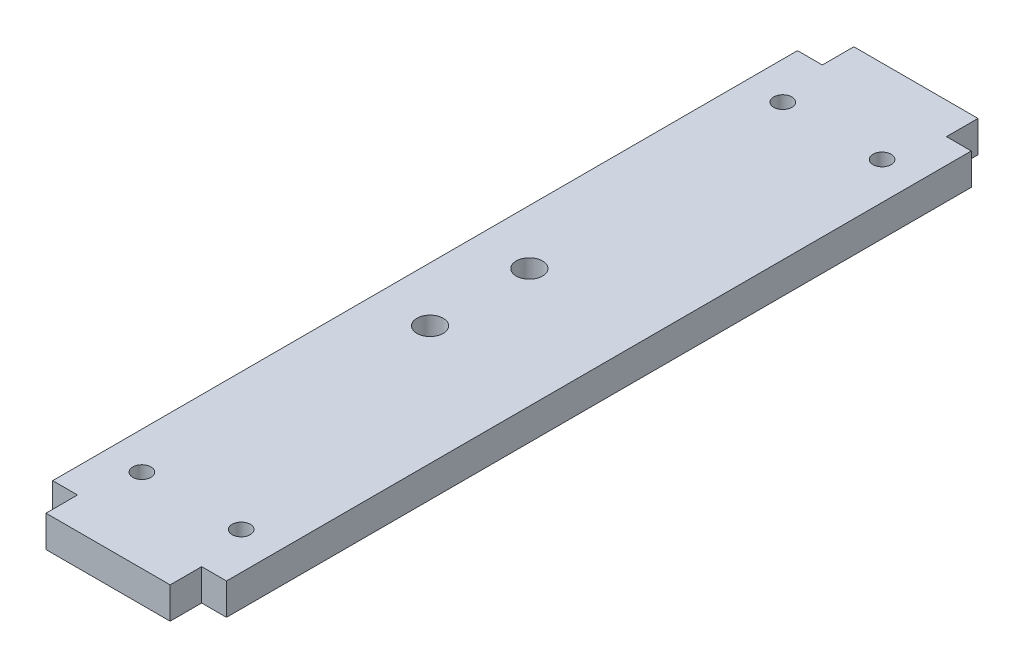
ISO-10303-21;
HEADER;
FILE_DESCRIPTION(('STEP AP214'),'2;1');
FILE_NAME('part.step','',(''),(''),'','','');
FILE_SCHEMA(('AUTOMOTIVE_DESIGN { 1 0 10303 214 1 1 1 1 }'));
ENDSEC;
DATA;
#1=APPLICATION_CONTEXT('core data for automotive mechanical design processes');
#2=APPLICATION_PROTOCOL_DEFINITION('international standard','automotive_design',2000,#1);
#3=PRODUCT_CONTEXT('',#1,'mechanical');
#4=PRODUCT('Part','Part','',(#3));
#5=PRODUCT_RELATED_PRODUCT_CATEGORY('part','',(#4));
#6=PRODUCT_DEFINITION_FORMATION('','',#4);
#7=PRODUCT_DEFINITION_CONTEXT('part definition',#1,'design');
#8=PRODUCT_DEFINITION('design','',#6,#7);
#9=PRODUCT_DEFINITION_SHAPE('','',#8);
#10=(LENGTH_UNIT() NAMED_UNIT(*) SI_UNIT(.MILLI.,.METRE.));
#11=(NAMED_UNIT(*) PLANE_ANGLE_UNIT() SI_UNIT($,.RADIAN.));
#12=(NAMED_UNIT(*) SI_UNIT($,.STERADIAN.) SOLID_ANGLE_UNIT());
#13=UNCERTAINTY_MEASURE_WITH_UNIT(LENGTH_MEASURE(1.E-05),#10,'distance_accuracy_value','');
#14=(GEOMETRIC_REPRESENTATION_CONTEXT(3) GLOBAL_UNCERTAINTY_ASSIGNED_CONTEXT((#13)) GLOBAL_UNIT_ASSIGNED_CONTEXT((#10,
#11,#12)) REPRESENTATION_CONTEXT('',''));
#15=CARTESIAN_POINT('',(0.,0.,0.));
#16=DIRECTION('',(0.,0.,1.));
#17=DIRECTION('',(1.,0.,0.));
#18=AXIS2_PLACEMENT_3D('',#15,#16,#17);
#19=CARTESIAN_POINT('',(17.5,6.35,-75.));
#20=DIRECTION('',(0.,0.,1.));
#21=DIRECTION('',(1.,0.,0.));
#22=AXIS2_PLACEMENT_3D('',#19,#20,#21);
#23=PLANE('',#22);
#24=DIRECTION('',(0.,1.,0.));
#25=VECTOR('',#24,1.);
#26=CARTESIAN_POINT('',(-12.4999999999999,0.,-75.));
#27=LINE('',#26,#25);
#28=CARTESIAN_POINT('',(-12.4999999999999,0.,-75.));
#29=VERTEX_POINT('',#28);
#30=CARTESIAN_POINT('',(-12.4999999999999,6.35,-75.));
#31=VERTEX_POINT('',#30);
#32=EDGE_CURVE('E156',#29,#31,#27,.T.);
#33=ORIENTED_EDGE('',*,*,#32,.F.);
#34=DIRECTION('',(-1.,0.,0.));
#35=VECTOR('',#34,1.);
#36=CARTESIAN_POINT('',(17.5,0.,-75.));
#37=LINE('',#36,#35);
#38=CARTESIAN_POINT('',(-17.5,0.,-75.));
#39=VERTEX_POINT('',#38);
#40=EDGE_CURVE('E205',#29,#39,#37,.T.);
#41=ORIENTED_EDGE('',*,*,#40,.T.);
#42=DIRECTION('',(0.,-1.,0.));
#43=VECTOR('',#42,1.);
#44=CARTESIAN_POINT('',(-17.5,6.35,-75.));
#45=LINE('',#44,#43);
#46=CARTESIAN_POINT('',(-17.5,6.35,-75.));
#47=VERTEX_POINT('',#46);
#48=EDGE_CURVE('E196',#47,#39,#45,.T.);
#49=ORIENTED_EDGE('',*,*,#48,.F.);
#50=DIRECTION('',(-1.,0.,0.));
#51=VECTOR('',#50,1.);
#52=CARTESIAN_POINT('',(17.5,6.35,-75.));
#53=LINE('',#52,#51);
#54=EDGE_CURVE('E192',#31,#47,#53,.T.);
#55=ORIENTED_EDGE('',*,*,#54,.F.);
#56=EDGE_LOOP('',(#33,#41,#49,#55));
#57=FACE_BOUND('',#56,.T.);
#58=ADVANCED_FACE('F32',(#57),#23,.F.);
#59=CARTESIAN_POINT('',(17.5,6.35,75.));
#60=DIRECTION('',(0.,0.,-1.));
#61=DIRECTION('',(-1.,0.,0.));
#62=AXIS2_PLACEMENT_3D('',#59,#60,#61);
#63=PLANE('',#62);
#64=DIRECTION('',(0.,1.,0.));
#65=VECTOR('',#64,1.);
#66=CARTESIAN_POINT('',(12.5000000000001,0.,75.));
#67=LINE('',#66,#65);
#68=CARTESIAN_POINT('',(12.5000000000001,0.,75.));
#69=VERTEX_POINT('',#68);
#70=CARTESIAN_POINT('',(12.5000000000001,6.35,75.));
#71=VERTEX_POINT('',#70);
#72=EDGE_CURVE('E168',#69,#71,#67,.T.);
#73=ORIENTED_EDGE('',*,*,#72,.F.);
#74=DIRECTION('',(1.,0.,0.));
#75=VECTOR('',#74,1.);
#76=CARTESIAN_POINT('',(17.5,0.,75.));
#77=LINE('',#76,#75);
#78=CARTESIAN_POINT('',(17.5,0.,75.));
#79=VERTEX_POINT('',#78);
#80=EDGE_CURVE('E199',#69,#79,#77,.T.);
#81=ORIENTED_EDGE('',*,*,#80,.T.);
#82=DIRECTION('',(0.,-1.,0.));
#83=VECTOR('',#82,1.);
#84=CARTESIAN_POINT('',(17.5,6.35,75.));
#85=LINE('',#84,#83);
#86=CARTESIAN_POINT('',(17.5,6.35,75.));
#87=VERTEX_POINT('',#86);
#88=EDGE_CURVE('E40',#87,#79,#85,.T.);
#89=ORIENTED_EDGE('',*,*,#88,.F.);
#90=DIRECTION('',(1.,0.,0.));
#91=VECTOR('',#90,1.);
#92=CARTESIAN_POINT('',(17.5,6.35,75.));
#93=LINE('',#92,#91);
#94=EDGE_CURVE('E185',#71,#87,#93,.T.);
#95=ORIENTED_EDGE('',*,*,#94,.F.);
#96=EDGE_LOOP('',(#73,#81,#89,#95));
#97=FACE_BOUND('',#96,.T.);
#98=ADVANCED_FACE('F229',(#97),#63,.F.);
#99=CARTESIAN_POINT('',(-17.5,6.35,75.));
#100=DIRECTION('',(1.,0.,0.));
#101=DIRECTION('',(0.,0.,-1.));
#102=AXIS2_PLACEMENT_3D('',#99,#100,#101);
#103=PLANE('',#102);
#104=DIRECTION('',(0.,0.,1.));
#105=VECTOR('',#104,1.);
#106=CARTESIAN_POINT('',(-17.5,0.,75.));
#107=LINE('',#106,#105);
#108=CARTESIAN_POINT('',(-17.5,0.,75.));
#109=VERTEX_POINT('',#108);
#110=EDGE_CURVE('E176',#39,#109,#107,.T.);
#111=ORIENTED_EDGE('',*,*,#110,.T.);
#112=DIRECTION('',(0.,-1.,0.));
#113=VECTOR('',#112,1.);
#114=CARTESIAN_POINT('',(-17.5,6.35,75.));
#115=LINE('',#114,#113);
#116=CARTESIAN_POINT('',(-17.5,6.35,75.));
#117=VERTEX_POINT('',#116);
#118=EDGE_CURVE('E11',#117,#109,#115,.T.);
#119=ORIENTED_EDGE('',*,*,#118,.F.);
#120=DIRECTION('',(0.,0.,1.));
#121=VECTOR('',#120,1.);
#122=CARTESIAN_POINT('',(-17.5,6.35,75.));
#123=LINE('',#122,#121);
#124=EDGE_CURVE('E182',#47,#117,#123,.T.);
#125=ORIENTED_EDGE('',*,*,#124,.F.);
#126=ORIENTED_EDGE('',*,*,#48,.T.);
#127=EDGE_LOOP('',(#111,#119,#125,#126));
#128=FACE_BOUND('',#127,.T.);
#129=ADVANCED_FACE('F34',(#128),#103,.F.);
#130=CARTESIAN_POINT('',(-12.4999999999999,0.,75.));
#131=VERTEX_POINT('',#130);
#132=EDGE_CURVE('E200',#109,#131,#77,.T.);
#133=ORIENTED_EDGE('',*,*,#132,.T.);
#134=DIRECTION('',(0.,1.,0.));
#135=VECTOR('',#134,1.);
#136=CARTESIAN_POINT('',(-12.4999999999999,0.,75.));
#137=LINE('',#136,#135);
#138=CARTESIAN_POINT('',(-12.4999999999999,6.35,75.));
#139=VERTEX_POINT('',#138);
#140=EDGE_CURVE('E179',#131,#139,#137,.T.);
#141=ORIENTED_EDGE('',*,*,#140,.T.);
#142=EDGE_CURVE('E187',#117,#139,#93,.T.);
#143=ORIENTED_EDGE('',*,*,#142,.F.);
#144=ORIENTED_EDGE('',*,*,#118,.T.);
#145=EDGE_LOOP('',(#133,#141,#143,#144));
#146=FACE_BOUND('',#145,.T.);
#147=ADVANCED_FACE('F239',(#146),#63,.F.);
#148=CARTESIAN_POINT('',(17.5,6.35,75.));
#149=DIRECTION('',(-1.,0.,0.));
#150=DIRECTION('',(0.,0.,1.));
#151=AXIS2_PLACEMENT_3D('',#148,#149,#150);
#152=PLANE('',#151);
#153=DIRECTION('',(0.,0.,-1.));
#154=VECTOR('',#153,1.);
#155=CARTESIAN_POINT('',(17.5,0.,75.));
#156=LINE('',#155,#154);
#157=CARTESIAN_POINT('',(17.5,0.,-75.));
#158=VERTEX_POINT('',#157);
#159=EDGE_CURVE('E203',#79,#158,#156,.T.);
#160=ORIENTED_EDGE('',*,*,#159,.T.);
#161=DIRECTION('',(0.,-1.,0.));
#162=VECTOR('',#161,1.);
#163=CARTESIAN_POINT('',(17.5,6.35,-75.));
#164=LINE('',#163,#162);
#165=CARTESIAN_POINT('',(17.5,6.35,-75.));
#166=VERTEX_POINT('',#165);
#167=EDGE_CURVE('E209',#166,#158,#164,.T.);
#168=ORIENTED_EDGE('',*,*,#167,.F.);
#169=DIRECTION('',(0.,0.,-1.));
#170=VECTOR('',#169,1.);
#171=CARTESIAN_POINT('',(17.5,6.35,75.));
#172=LINE('',#171,#170);
#173=EDGE_CURVE('E190',#87,#166,#172,.T.);
#174=ORIENTED_EDGE('',*,*,#173,.F.);
#175=ORIENTED_EDGE('',*,*,#88,.T.);
#176=EDGE_LOOP('',(#160,#168,#174,#175));
#177=FACE_BOUND('',#176,.T.);
#178=ADVANCED_FACE('F216',(#177),#152,.F.);
#179=CARTESIAN_POINT('',(12.5000000000001,0.,-75.));
#180=VERTEX_POINT('',#179);
#181=EDGE_CURVE('E186',#158,#180,#37,.T.);
#182=ORIENTED_EDGE('',*,*,#181,.T.);
#183=DIRECTION('',(0.,1.,0.));
#184=VECTOR('',#183,1.);
#185=CARTESIAN_POINT('',(12.5000000000001,0.,-75.));
#186=LINE('',#185,#184);
#187=CARTESIAN_POINT('',(12.5000000000001,6.35,-75.));
#188=VERTEX_POINT('',#187);
#189=EDGE_CURVE('E142',#180,#188,#186,.T.);
#190=ORIENTED_EDGE('',*,*,#189,.T.);
#191=EDGE_CURVE('E193',#166,#188,#53,.T.);
#192=ORIENTED_EDGE('',*,*,#191,.F.);
#193=ORIENTED_EDGE('',*,*,#167,.T.);
#194=EDGE_LOOP('',(#182,#190,#192,#193));
#195=FACE_BOUND('',#194,.T.);
#196=ADVANCED_FACE('F223',(#195),#23,.F.);
#197=CARTESIAN_POINT('',(0.,6.35,0.));
#198=DIRECTION('',(0.,1.,0.));
#199=DIRECTION('',(0.,0.,1.));
#200=AXIS2_PLACEMENT_3D('',#197,#198,#199);
#201=PLANE('',#200);
#202=CARTESIAN_POINT('',(-6.5,6.35,10.));
#203=DIRECTION('',(0.,1.,0.));
#204=DIRECTION('',(0.,0.,1.));
#205=AXIS2_PLACEMENT_3D('',#202,#203,#204);
#206=CIRCLE('',#205,2.65);
#207=CARTESIAN_POINT('',(-6.5,6.35,12.65));
#208=VERTEX_POINT('',#207);
#209=EDGE_CURVE('E423',#208,#208,#206,.T.);
#210=ORIENTED_EDGE('',*,*,#209,.F.);
#211=EDGE_LOOP('',(#210));
#212=FACE_BOUND('',#211,.T.);
#213=CARTESIAN_POINT('',(-6.5,6.35,-10.));
#214=DIRECTION('',(0.,1.,0.));
#215=DIRECTION('',(0.,0.,1.));
#216=AXIS2_PLACEMENT_3D('',#213,#214,#215);
#217=CIRCLE('',#216,2.65);
#218=CARTESIAN_POINT('',(-6.5,6.35,-7.35));
#219=VERTEX_POINT('',#218);
#220=EDGE_CURVE('E425',#219,#219,#217,.T.);
#221=ORIENTED_EDGE('',*,*,#220,.F.);
#222=EDGE_LOOP('',(#221));
#223=FACE_BOUND('',#222,.T.);
#224=CARTESIAN_POINT('',(-10.,6.35,-64.5352));
#225=DIRECTION('',(0.,1.,0.));
#226=DIRECTION('',(0.,0.,1.));
#227=AXIS2_PLACEMENT_3D('',#224,#225,#226);
#228=CIRCLE('',#227,1.8288);
#229=CARTESIAN_POINT('',(-10.,6.35,-62.7064));
#230=VERTEX_POINT('',#229);
#231=EDGE_CURVE('E433',#230,#230,#228,.T.);
#232=ORIENTED_EDGE('',*,*,#231,.F.);
#233=EDGE_LOOP('',(#232));
#234=FACE_BOUND('',#233,.T.);
#235=CARTESIAN_POINT('',(10.,6.35,-64.5352));
#236=DIRECTION('',(0.,1.,0.));
#237=DIRECTION('',(0.,0.,1.));
#238=AXIS2_PLACEMENT_3D('',#235,#236,#237);
#239=CIRCLE('',#238,1.8288);
#240=CARTESIAN_POINT('',(10.,6.35,-62.7064));
#241=VERTEX_POINT('',#240);
#242=EDGE_CURVE('E439',#241,#241,#239,.T.);
#243=ORIENTED_EDGE('',*,*,#242,.F.);
#244=EDGE_LOOP('',(#243));
#245=FACE_BOUND('',#244,.T.);
#246=CARTESIAN_POINT('',(10.,6.35,64.5352));
#247=DIRECTION('',(0.,1.,0.));
#248=DIRECTION('',(0.,0.,1.));
#249=AXIS2_PLACEMENT_3D('',#246,#247,#248);
#250=CIRCLE('',#249,1.8288);
#251=CARTESIAN_POINT('',(10.,6.35,66.364));
#252=VERTEX_POINT('',#251);
#253=EDGE_CURVE('E445',#252,#252,#250,.T.);
#254=ORIENTED_EDGE('',*,*,#253,.F.);
#255=EDGE_LOOP('',(#254));
#256=FACE_BOUND('',#255,.T.);
#257=CARTESIAN_POINT('',(-10.,6.35,64.5352));
#258=DIRECTION('',(0.,1.,0.));
#259=DIRECTION('',(0.,0.,1.));
#260=AXIS2_PLACEMENT_3D('',#257,#258,#259);
#261=CIRCLE('',#260,1.8288);
#262=CARTESIAN_POINT('',(-10.,6.35,66.364));
#263=VERTEX_POINT('',#262);
#264=EDGE_CURVE('E450',#263,#263,#261,.T.);
#265=ORIENTED_EDGE('',*,*,#264,.F.);
#266=EDGE_LOOP('',(#265));
#267=FACE_BOUND('',#266,.T.);
#268=ORIENTED_EDGE('',*,*,#124,.T.);
#269=ORIENTED_EDGE('',*,*,#142,.T.);
#270=DIRECTION('',(0.,0.,1.));
#271=VECTOR('',#270,1.);
#272=CARTESIAN_POINT('',(-12.4999999999999,6.35,81.35));
#273=LINE('',#272,#271);
#274=CARTESIAN_POINT('',(-12.4999999999999,6.35,81.35));
#275=VERTEX_POINT('',#274);
#276=EDGE_CURVE('E55',#139,#275,#273,.T.);
#277=ORIENTED_EDGE('',*,*,#276,.T.);
#278=DIRECTION('',(1.,0.,0.));
#279=VECTOR('',#278,1.);
#280=CARTESIAN_POINT('',(-12.4999999999999,6.35,81.35));
#281=LINE('',#280,#279);
#282=CARTESIAN_POINT('',(12.5000000000001,6.35,81.35));
#283=VERTEX_POINT('',#282);
#284=EDGE_CURVE('E162',#275,#283,#281,.T.);
#285=ORIENTED_EDGE('',*,*,#284,.T.);
#286=DIRECTION('',(0.,0.,-1.));
#287=VECTOR('',#286,1.);
#288=CARTESIAN_POINT('',(12.5000000000001,6.35,81.35));
#289=LINE('',#288,#287);
#290=EDGE_CURVE('E155',#283,#71,#289,.T.);
#291=ORIENTED_EDGE('',*,*,#290,.T.);
#292=ORIENTED_EDGE('',*,*,#94,.T.);
#293=ORIENTED_EDGE('',*,*,#173,.T.);
#294=ORIENTED_EDGE('',*,*,#191,.T.);
#295=DIRECTION('',(0.,0.,-1.));
#296=VECTOR('',#295,1.);
#297=CARTESIAN_POINT('',(12.5000000000001,6.35,-81.35));
#298=LINE('',#297,#296);
#299=CARTESIAN_POINT('',(12.5000000000001,6.35,-81.35));
#300=VERTEX_POINT('',#299);
#301=EDGE_CURVE('E47',#188,#300,#298,.T.);
#302=ORIENTED_EDGE('',*,*,#301,.T.);
#303=DIRECTION('',(-1.,0.,0.));
#304=VECTOR('',#303,1.);
#305=CARTESIAN_POINT('',(-12.4999999999999,6.35,-81.35));
#306=LINE('',#305,#304);
#307=CARTESIAN_POINT('',(-12.4999999999999,6.35,-81.35));
#308=VERTEX_POINT('',#307);
#309=EDGE_CURVE('E126',#300,#308,#306,.T.);
#310=ORIENTED_EDGE('',*,*,#309,.T.);
#311=DIRECTION('',(0.,0.,1.));
#312=VECTOR('',#311,1.);
#313=CARTESIAN_POINT('',(-12.4999999999999,6.35,-81.35));
#314=LINE('',#313,#312);
#315=EDGE_CURVE('E143',#308,#31,#314,.T.);
#316=ORIENTED_EDGE('',*,*,#315,.T.);
#317=ORIENTED_EDGE('',*,*,#54,.T.);
#318=EDGE_LOOP('',(#268,#269,#277,#285,#291,#292,#293,#294,#302,#310,#316,#317));
#319=FACE_BOUND('',#318,.T.);
#320=ADVANCED_FACE('F226',(#212,#223,#234,#245,#256,#267,#319),#201,.T.);
#321=CARTESIAN_POINT('',(0.,0.,0.));
#322=DIRECTION('',(0.,1.,0.));
#323=DIRECTION('',(0.,0.,1.));
#324=AXIS2_PLACEMENT_3D('',#321,#322,#323);
#325=PLANE('',#324);
#326=CARTESIAN_POINT('',(-6.5,0.,10.));
#327=DIRECTION('',(0.,1.,0.));
#328=DIRECTION('',(0.,0.,1.));
#329=AXIS2_PLACEMENT_3D('',#326,#327,#328);
#330=CIRCLE('',#329,2.65);
#331=CARTESIAN_POINT('',(-6.5,0.,12.65));
#332=VERTEX_POINT('',#331);
#333=EDGE_CURVE('E420',#332,#332,#330,.T.);
#334=ORIENTED_EDGE('',*,*,#333,.T.);
#335=EDGE_LOOP('',(#334));
#336=FACE_BOUND('',#335,.T.);
#337=CARTESIAN_POINT('',(-6.5,0.,-10.));
#338=DIRECTION('',(0.,1.,0.));
#339=DIRECTION('',(0.,0.,1.));
#340=AXIS2_PLACEMENT_3D('',#337,#338,#339);
#341=CIRCLE('',#340,2.65);
#342=CARTESIAN_POINT('',(-6.5,0.,-7.35));
#343=VERTEX_POINT('',#342);
#344=EDGE_CURVE('E430',#343,#343,#341,.T.);
#345=ORIENTED_EDGE('',*,*,#344,.T.);
#346=EDGE_LOOP('',(#345));
#347=FACE_BOUND('',#346,.T.);
#348=CARTESIAN_POINT('',(-10.,0.,-64.5352));
#349=DIRECTION('',(0.,1.,0.));
#350=DIRECTION('',(0.,0.,1.));
#351=AXIS2_PLACEMENT_3D('',#348,#349,#350);
#352=CIRCLE('',#351,1.8288);
#353=CARTESIAN_POINT('',(-10.,0.,-62.7064));
#354=VERTEX_POINT('',#353);
#355=EDGE_CURVE('E436',#354,#354,#352,.T.);
#356=ORIENTED_EDGE('',*,*,#355,.T.);
#357=EDGE_LOOP('',(#356));
#358=FACE_BOUND('',#357,.T.);
#359=CARTESIAN_POINT('',(10.,0.,-64.5352));
#360=DIRECTION('',(0.,1.,0.));
#361=DIRECTION('',(0.,0.,1.));
#362=AXIS2_PLACEMENT_3D('',#359,#360,#361);
#363=CIRCLE('',#362,1.8288);
#364=CARTESIAN_POINT('',(10.,0.,-62.7064));
#365=VERTEX_POINT('',#364);
#366=EDGE_CURVE('E442',#365,#365,#363,.T.);
#367=ORIENTED_EDGE('',*,*,#366,.T.);
#368=EDGE_LOOP('',(#367));
#369=FACE_BOUND('',#368,.T.);
#370=CARTESIAN_POINT('',(10.,0.,64.5352));
#371=DIRECTION('',(0.,1.,0.));
#372=DIRECTION('',(0.,0.,1.));
#373=AXIS2_PLACEMENT_3D('',#370,#371,#372);
#374=CIRCLE('',#373,1.8288);
#375=CARTESIAN_POINT('',(10.,0.,66.364));
#376=VERTEX_POINT('',#375);
#377=EDGE_CURVE('E448',#376,#376,#374,.T.);
#378=ORIENTED_EDGE('',*,*,#377,.T.);
#379=EDGE_LOOP('',(#378));
#380=FACE_BOUND('',#379,.T.);
#381=CARTESIAN_POINT('',(-10.,0.,64.5352));
#382=DIRECTION('',(0.,1.,0.));
#383=DIRECTION('',(0.,0.,1.));
#384=AXIS2_PLACEMENT_3D('',#381,#382,#383);
#385=CIRCLE('',#384,1.8288);
#386=CARTESIAN_POINT('',(-10.,0.,66.364));
#387=VERTEX_POINT('',#386);
#388=EDGE_CURVE('E148',#387,#387,#385,.T.);
#389=ORIENTED_EDGE('',*,*,#388,.T.);
#390=EDGE_LOOP('',(#389));
#391=FACE_BOUND('',#390,.T.);
#392=ORIENTED_EDGE('',*,*,#110,.F.);
#393=ORIENTED_EDGE('',*,*,#40,.F.);
#394=DIRECTION('',(0.,0.,1.));
#395=VECTOR('',#394,1.);
#396=CARTESIAN_POINT('',(-12.4999999999999,0.,-81.35));
#397=LINE('',#396,#395);
#398=CARTESIAN_POINT('',(-12.4999999999999,0.,-81.35));
#399=VERTEX_POINT('',#398);
#400=EDGE_CURVE('E129',#399,#29,#397,.T.);
#401=ORIENTED_EDGE('',*,*,#400,.F.);
#402=DIRECTION('',(-1.,0.,0.));
#403=VECTOR('',#402,1.);
#404=CARTESIAN_POINT('',(-12.4999999999999,0.,-81.35));
#405=LINE('',#404,#403);
#406=CARTESIAN_POINT('',(12.5000000000001,0.,-81.35));
#407=VERTEX_POINT('',#406);
#408=EDGE_CURVE('E124',#407,#399,#405,.T.);
#409=ORIENTED_EDGE('',*,*,#408,.F.);
#410=DIRECTION('',(0.,0.,-1.));
#411=VECTOR('',#410,1.);
#412=CARTESIAN_POINT('',(12.5000000000001,0.,-81.35));
#413=LINE('',#412,#411);
#414=EDGE_CURVE('E137',#180,#407,#413,.T.);
#415=ORIENTED_EDGE('',*,*,#414,.F.);
#416=ORIENTED_EDGE('',*,*,#181,.F.);
#417=ORIENTED_EDGE('',*,*,#159,.F.);
#418=ORIENTED_EDGE('',*,*,#80,.F.);
#419=DIRECTION('',(0.,0.,-1.));
#420=VECTOR('',#419,1.);
#421=CARTESIAN_POINT('',(12.5000000000001,0.,81.35));
#422=LINE('',#421,#420);
#423=CARTESIAN_POINT('',(12.5000000000001,0.,81.35));
#424=VERTEX_POINT('',#423);
#425=EDGE_CURVE('E159',#424,#69,#422,.T.);
#426=ORIENTED_EDGE('',*,*,#425,.F.);
#427=DIRECTION('',(1.,0.,0.));
#428=VECTOR('',#427,1.);
#429=CARTESIAN_POINT('',(-12.4999999999999,0.,81.35));
#430=LINE('',#429,#428);
#431=CARTESIAN_POINT('',(-12.4999999999999,0.,81.35));
#432=VERTEX_POINT('',#431);
#433=EDGE_CURVE('E165',#432,#424,#430,.T.);
#434=ORIENTED_EDGE('',*,*,#433,.F.);
#435=DIRECTION('',(0.,0.,1.));
#436=VECTOR('',#435,1.);
#437=CARTESIAN_POINT('',(-12.4999999999999,0.,81.35));
#438=LINE('',#437,#436);
#439=EDGE_CURVE('E161',#131,#432,#438,.T.);
#440=ORIENTED_EDGE('',*,*,#439,.F.);
#441=ORIENTED_EDGE('',*,*,#132,.F.);
#442=EDGE_LOOP('',(#392,#393,#401,#409,#415,#416,#417,#418,#426,#434,#440,#441));
#443=FACE_BOUND('',#442,.T.);
#444=ADVANCED_FACE('F135',(#336,#347,#358,#369,#380,#391,#443),#325,.F.);
#445=CARTESIAN_POINT('',(12.5000000000001,0.,81.35));
#446=DIRECTION('',(1.,0.,0.));
#447=DIRECTION('',(0.,0.,-1.));
#448=AXIS2_PLACEMENT_3D('',#445,#446,#447);
#449=PLANE('',#448);
#450=ORIENTED_EDGE('',*,*,#290,.F.);
#451=DIRECTION('',(0.,1.,0.));
#452=VECTOR('',#451,1.);
#453=CARTESIAN_POINT('',(12.5000000000001,0.,81.35));
#454=LINE('',#453,#452);
#455=EDGE_CURVE('E174',#424,#283,#454,.T.);
#456=ORIENTED_EDGE('',*,*,#455,.F.);
#457=ORIENTED_EDGE('',*,*,#425,.T.);
#458=ORIENTED_EDGE('',*,*,#72,.T.);
#459=EDGE_LOOP('',(#450,#456,#457,#458));
#460=FACE_BOUND('',#459,.T.);
#461=ADVANCED_FACE('F231',(#460),#449,.T.);
#462=CARTESIAN_POINT('',(-12.4999999999999,0.,81.35));
#463=DIRECTION('',(0.,0.,1.));
#464=DIRECTION('',(1.,0.,0.));
#465=AXIS2_PLACEMENT_3D('',#462,#463,#464);
#466=PLANE('',#465);
#467=ORIENTED_EDGE('',*,*,#284,.F.);
#468=DIRECTION('',(0.,1.,0.));
#469=VECTOR('',#468,1.);
#470=CARTESIAN_POINT('',(-12.4999999999999,0.,81.35));
#471=LINE('',#470,#469);
#472=EDGE_CURVE('E177',#432,#275,#471,.T.);
#473=ORIENTED_EDGE('',*,*,#472,.F.);
#474=ORIENTED_EDGE('',*,*,#433,.T.);
#475=ORIENTED_EDGE('',*,*,#455,.T.);
#476=EDGE_LOOP('',(#467,#473,#474,#475));
#477=FACE_BOUND('',#476,.T.);
#478=ADVANCED_FACE('F236',(#477),#466,.T.);
#479=CARTESIAN_POINT('',(-12.4999999999999,0.,81.35));
#480=DIRECTION('',(-1.,0.,0.));
#481=DIRECTION('',(0.,0.,1.));
#482=AXIS2_PLACEMENT_3D('',#479,#480,#481);
#483=PLANE('',#482);
#484=ORIENTED_EDGE('',*,*,#276,.F.);
#485=ORIENTED_EDGE('',*,*,#140,.F.);
#486=ORIENTED_EDGE('',*,*,#439,.T.);
#487=ORIENTED_EDGE('',*,*,#472,.T.);
#488=EDGE_LOOP('',(#484,#485,#486,#487));
#489=FACE_BOUND('',#488,.T.);
#490=ADVANCED_FACE('F237',(#489),#483,.T.);
#491=CARTESIAN_POINT('',(12.5000000000001,0.,-81.35));
#492=DIRECTION('',(1.,0.,0.));
#493=DIRECTION('',(0.,0.,-1.));
#494=AXIS2_PLACEMENT_3D('',#491,#492,#493);
#495=PLANE('',#494);
#496=ORIENTED_EDGE('',*,*,#301,.F.);
#497=ORIENTED_EDGE('',*,*,#189,.F.);
#498=ORIENTED_EDGE('',*,*,#414,.T.);
#499=DIRECTION('',(0.,1.,0.));
#500=VECTOR('',#499,1.);
#501=CARTESIAN_POINT('',(12.5000000000001,0.,-81.35));
#502=LINE('',#501,#500);
#503=EDGE_CURVE('E121',#407,#300,#502,.T.);
#504=ORIENTED_EDGE('',*,*,#503,.T.);
#505=EDGE_LOOP('',(#496,#497,#498,#504));
#506=FACE_BOUND('',#505,.T.);
#507=ADVANCED_FACE('F141',(#506),#495,.T.);
#508=CARTESIAN_POINT('',(-12.4999999999999,0.,-81.35));
#509=DIRECTION('',(-1.,0.,0.));
#510=DIRECTION('',(0.,0.,1.));
#511=AXIS2_PLACEMENT_3D('',#508,#509,#510);
#512=PLANE('',#511);
#513=ORIENTED_EDGE('',*,*,#315,.F.);
#514=DIRECTION('',(0.,1.,0.));
#515=VECTOR('',#514,1.);
#516=CARTESIAN_POINT('',(-12.4999999999999,0.,-81.35));
#517=LINE('',#516,#515);
#518=EDGE_CURVE('E128',#399,#308,#517,.T.);
#519=ORIENTED_EDGE('',*,*,#518,.F.);
#520=ORIENTED_EDGE('',*,*,#400,.T.);
#521=ORIENTED_EDGE('',*,*,#32,.T.);
#522=EDGE_LOOP('',(#513,#519,#520,#521));
#523=FACE_BOUND('',#522,.T.);
#524=ADVANCED_FACE('F249',(#523),#512,.T.);
#525=CARTESIAN_POINT('',(-12.4999999999999,0.,-81.35));
#526=DIRECTION('',(0.,0.,-1.));
#527=DIRECTION('',(-1.,0.,0.));
#528=AXIS2_PLACEMENT_3D('',#525,#526,#527);
#529=PLANE('',#528);
#530=ORIENTED_EDGE('',*,*,#309,.F.);
#531=ORIENTED_EDGE('',*,*,#503,.F.);
#532=ORIENTED_EDGE('',*,*,#408,.T.);
#533=ORIENTED_EDGE('',*,*,#518,.T.);
#534=EDGE_LOOP('',(#530,#531,#532,#533));
#535=FACE_BOUND('',#534,.T.);
#536=ADVANCED_FACE('F123',(#535),#529,.T.);
#537=CARTESIAN_POINT('',(-10.,6.35,64.5352));
#538=DIRECTION('',(0.,1.,0.));
#539=DIRECTION('',(0.,0.,1.));
#540=AXIS2_PLACEMENT_3D('',#537,#538,#539);
#541=CYLINDRICAL_SURFACE('',#540,1.8288);
#542=ORIENTED_EDGE('',*,*,#388,.F.);
#543=EDGE_LOOP('',(#542));
#544=FACE_BOUND('',#543,.T.);
#545=ORIENTED_EDGE('',*,*,#264,.T.);
#546=EDGE_LOOP('',(#545));
#547=FACE_BOUND('',#546,.T.);
#548=ADVANCED_FACE('F256',(#544,#547),#541,.F.);
#549=CARTESIAN_POINT('',(10.,6.35,64.5352));
#550=DIRECTION('',(0.,1.,0.));
#551=DIRECTION('',(0.,0.,1.));
#552=AXIS2_PLACEMENT_3D('',#549,#550,#551);
#553=CYLINDRICAL_SURFACE('',#552,1.8288);
#554=ORIENTED_EDGE('',*,*,#377,.F.);
#555=EDGE_LOOP('',(#554));
#556=FACE_BOUND('',#555,.T.);
#557=ORIENTED_EDGE('',*,*,#253,.T.);
#558=EDGE_LOOP('',(#557));
#559=FACE_BOUND('',#558,.T.);
#560=ADVANCED_FACE('F350',(#556,#559),#553,.F.);
#561=CARTESIAN_POINT('',(10.,6.35,-64.5352));
#562=DIRECTION('',(0.,1.,0.));
#563=DIRECTION('',(0.,0.,1.));
#564=AXIS2_PLACEMENT_3D('',#561,#562,#563);
#565=CYLINDRICAL_SURFACE('',#564,1.8288);
#566=ORIENTED_EDGE('',*,*,#366,.F.);
#567=EDGE_LOOP('',(#566));
#568=FACE_BOUND('',#567,.T.);
#569=ORIENTED_EDGE('',*,*,#242,.T.);
#570=EDGE_LOOP('',(#569));
#571=FACE_BOUND('',#570,.T.);
#572=ADVANCED_FACE('F359',(#568,#571),#565,.F.);
#573=CARTESIAN_POINT('',(-10.,6.35,-64.5352));
#574=DIRECTION('',(0.,1.,0.));
#575=DIRECTION('',(0.,0.,1.));
#576=AXIS2_PLACEMENT_3D('',#573,#574,#575);
#577=CYLINDRICAL_SURFACE('',#576,1.8288);
#578=ORIENTED_EDGE('',*,*,#355,.F.);
#579=EDGE_LOOP('',(#578));
#580=FACE_BOUND('',#579,.T.);
#581=ORIENTED_EDGE('',*,*,#231,.T.);
#582=EDGE_LOOP('',(#581));
#583=FACE_BOUND('',#582,.T.);
#584=ADVANCED_FACE('F369',(#580,#583),#577,.F.);
#585=CARTESIAN_POINT('',(-6.5,6.35,-10.));
#586=DIRECTION('',(0.,1.,0.));
#587=DIRECTION('',(0.,0.,1.));
#588=AXIS2_PLACEMENT_3D('',#585,#586,#587);
#589=CYLINDRICAL_SURFACE('',#588,2.65);
#590=ORIENTED_EDGE('',*,*,#344,.F.);
#591=EDGE_LOOP('',(#590));
#592=FACE_BOUND('',#591,.T.);
#593=ORIENTED_EDGE('',*,*,#220,.T.);
#594=EDGE_LOOP('',(#593));
#595=FACE_BOUND('',#594,.T.);
#596=ADVANCED_FACE('F379',(#592,#595),#589,.F.);
#597=CARTESIAN_POINT('',(-6.5,6.35,10.));
#598=DIRECTION('',(0.,1.,0.));
#599=DIRECTION('',(0.,0.,1.));
#600=AXIS2_PLACEMENT_3D('',#597,#598,#599);
#601=CYLINDRICAL_SURFACE('',#600,2.65);
#602=ORIENTED_EDGE('',*,*,#333,.F.);
#603=EDGE_LOOP('',(#602));
#604=FACE_BOUND('',#603,.T.);
#605=ORIENTED_EDGE('',*,*,#209,.T.);
#606=EDGE_LOOP('',(#605));
#607=FACE_BOUND('',#606,.T.);
#608=ADVANCED_FACE('F403',(#604,#607),#601,.F.);
#609=CLOSED_SHELL('',(#58,#98,#129,#147,#178,#196,#320,#444,#461,#478,#490,#507,#524,#536,#548,
#560,#572,#584,#596,#608));
#610=MANIFOLD_SOLID_BREP('B2',#609);
#611=ADVANCED_BREP_SHAPE_REPRESENTATION('',(#18,#610),#14);
#612=SHAPE_DEFINITION_REPRESENTATION(#9,#611);
ENDSEC;
END-ISO-10303-21;
